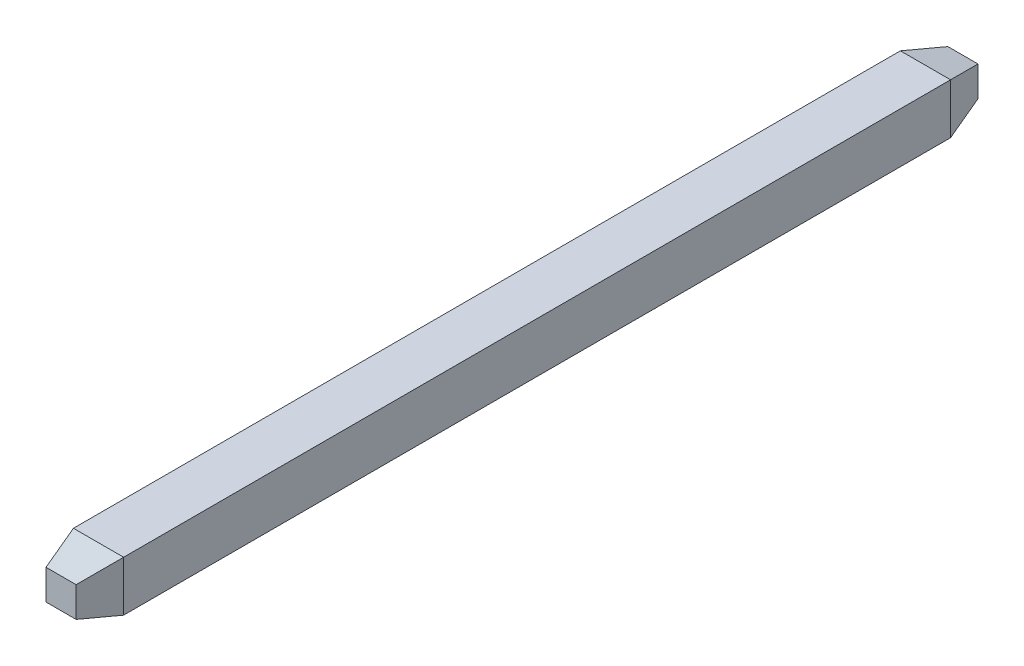
ISO-10303-21;
HEADER;
FILE_DESCRIPTION(('STEP AP214'),'2;1');
FILE_NAME('part.step','',(''),(''),'','','');
FILE_SCHEMA(('AUTOMOTIVE_DESIGN { 1 0 10303 214 1 1 1 1 }'));
ENDSEC;
DATA;
#1=APPLICATION_CONTEXT('core data for automotive mechanical design processes');
#2=APPLICATION_PROTOCOL_DEFINITION('international standard','automotive_design',2000,#1);
#3=PRODUCT_CONTEXT('',#1,'mechanical');
#4=PRODUCT('Part','Part','',(#3));
#5=PRODUCT_RELATED_PRODUCT_CATEGORY('part','',(#4));
#6=PRODUCT_DEFINITION_FORMATION('','',#4);
#7=PRODUCT_DEFINITION_CONTEXT('part definition',#1,'design');
#8=PRODUCT_DEFINITION('design','',#6,#7);
#9=PRODUCT_DEFINITION_SHAPE('','',#8);
#10=(LENGTH_UNIT() NAMED_UNIT(*) SI_UNIT(.MILLI.,.METRE.));
#11=(NAMED_UNIT(*) PLANE_ANGLE_UNIT() SI_UNIT($,.RADIAN.));
#12=(NAMED_UNIT(*) SI_UNIT($,.STERADIAN.) SOLID_ANGLE_UNIT());
#13=UNCERTAINTY_MEASURE_WITH_UNIT(LENGTH_MEASURE(1.E-05),#10,'distance_accuracy_value','');
#14=(GEOMETRIC_REPRESENTATION_CONTEXT(3) GLOBAL_UNCERTAINTY_ASSIGNED_CONTEXT((#13)) GLOBAL_UNIT_ASSIGNED_CONTEXT((#10,
#11,#12)) REPRESENTATION_CONTEXT('',''));
#15=CARTESIAN_POINT('',(0.,0.,0.));
#16=DIRECTION('',(0.,0.,1.));
#17=DIRECTION('',(1.,0.,0.));
#18=AXIS2_PLACEMENT_3D('',#15,#16,#17);
#19=CARTESIAN_POINT('',(0.32,-1.53140500673763,7.92229749663118));
#20=DIRECTION('',(0.965925826289069,0.,0.25881904510252));
#21=DIRECTION('',(0.,-1.,0.));
#22=AXIS2_PLACEMENT_3D('',#19,#20,#21);
#23=PLANE('',#22);
#24=DIRECTION('',(0.,1.,0.));
#25=VECTOR('',#24,1.);
#26=CARTESIAN_POINT('',(0.32,-0.32,7.92229749663118));
#27=LINE('',#26,#25);
#28=CARTESIAN_POINT('',(0.32,-0.32,7.92229749663118));
#29=VERTEX_POINT('',#28);
#30=CARTESIAN_POINT('',(0.32,0.32,7.92229749663118));
#31=VERTEX_POINT('',#30);
#32=EDGE_CURVE('E162',#29,#31,#27,.T.);
#33=ORIENTED_EDGE('',*,*,#32,.T.);
#34=DIRECTION('',(-0.250562807085731,-0.25056280708573,0.93511312653103));
#35=VECTOR('',#34,1.);
#36=CARTESIAN_POINT('',(0.32,0.32,7.92229749663118));
#37=LINE('',#36,#35);
#38=CARTESIAN_POINT('',(0.192,0.192,8.4));
#39=VERTEX_POINT('',#38);
#40=EDGE_CURVE('E103',#31,#39,#37,.T.);
#41=ORIENTED_EDGE('',*,*,#40,.T.);
#42=DIRECTION('',(0.,1.,0.));
#43=VECTOR('',#42,1.);
#44=CARTESIAN_POINT('',(0.192,-0.192,8.4));
#45=LINE('',#44,#43);
#46=CARTESIAN_POINT('',(0.192,-0.192,8.4));
#47=VERTEX_POINT('',#46);
#48=EDGE_CURVE('E180',#47,#39,#45,.T.);
#49=ORIENTED_EDGE('',*,*,#48,.F.);
#50=DIRECTION('',(-0.25056280708573,0.250562807085731,0.93511312653103));
#51=VECTOR('',#50,1.);
#52=CARTESIAN_POINT('',(0.32,-0.32,7.92229749663118));
#53=LINE('',#52,#51);
#54=EDGE_CURVE('E11',#29,#47,#53,.T.);
#55=ORIENTED_EDGE('',*,*,#54,.F.);
#56=EDGE_LOOP('',(#33,#41,#49,#55));
#57=FACE_BOUND('',#56,.T.);
#58=ADVANCED_FACE('F17',(#57),#23,.T.);
#59=CARTESIAN_POINT('',(-1.53140500673763,-0.32,7.92229749663118));
#60=DIRECTION('',(0.,-0.965925826289069,0.25881904510252));
#61=DIRECTION('',(-1.,0.,0.));
#62=AXIS2_PLACEMENT_3D('',#59,#60,#61);
#63=PLANE('',#62);
#64=DIRECTION('',(1.,0.,0.));
#65=VECTOR('',#64,1.);
#66=CARTESIAN_POINT('',(-0.32,-0.32,7.92229749663118));
#67=LINE('',#66,#65);
#68=CARTESIAN_POINT('',(-0.32,-0.32,7.92229749663118));
#69=VERTEX_POINT('',#68);
#70=EDGE_CURVE('E148',#69,#29,#67,.T.);
#71=ORIENTED_EDGE('',*,*,#70,.T.);
#72=ORIENTED_EDGE('',*,*,#54,.T.);
#73=DIRECTION('',(1.,0.,0.));
#74=VECTOR('',#73,1.);
#75=CARTESIAN_POINT('',(-0.192,-0.192,8.4));
#76=LINE('',#75,#74);
#77=CARTESIAN_POINT('',(-0.192,-0.192,8.4));
#78=VERTEX_POINT('',#77);
#79=EDGE_CURVE('E184',#78,#47,#76,.T.);
#80=ORIENTED_EDGE('',*,*,#79,.F.);
#81=DIRECTION('',(0.250562807085731,0.250562807085731,0.93511312653103));
#82=VECTOR('',#81,1.);
#83=CARTESIAN_POINT('',(-0.32,-0.32,7.92229749663118));
#84=LINE('',#83,#82);
#85=EDGE_CURVE('E28',#69,#78,#84,.T.);
#86=ORIENTED_EDGE('',*,*,#85,.F.);
#87=EDGE_LOOP('',(#71,#72,#80,#86));
#88=FACE_BOUND('',#87,.T.);
#89=ADVANCED_FACE('F320',(#88),#63,.T.);
#90=CARTESIAN_POINT('',(-0.32,1.53140500673763,7.92229749663118));
#91=DIRECTION('',(-0.965925826289069,0.,0.25881904510252));
#92=DIRECTION('',(0.,1.,0.));
#93=AXIS2_PLACEMENT_3D('',#90,#91,#92);
#94=PLANE('',#93);
#95=DIRECTION('',(0.,-1.,0.));
#96=VECTOR('',#95,1.);
#97=CARTESIAN_POINT('',(-0.32,0.32,7.92229749663118));
#98=LINE('',#97,#96);
#99=CARTESIAN_POINT('',(-0.32,0.32,7.92229749663118));
#100=VERTEX_POINT('',#99);
#101=EDGE_CURVE('E94',#100,#69,#98,.T.);
#102=ORIENTED_EDGE('',*,*,#101,.T.);
#103=ORIENTED_EDGE('',*,*,#85,.T.);
#104=DIRECTION('',(0.,-1.,0.));
#105=VECTOR('',#104,1.);
#106=CARTESIAN_POINT('',(-0.192,0.192,8.4));
#107=LINE('',#106,#105);
#108=CARTESIAN_POINT('',(-0.192,0.192,8.4));
#109=VERTEX_POINT('',#108);
#110=EDGE_CURVE('E97',#109,#78,#107,.T.);
#111=ORIENTED_EDGE('',*,*,#110,.F.);
#112=DIRECTION('',(0.250562807085731,-0.250562807085731,0.93511312653103));
#113=VECTOR('',#112,1.);
#114=CARTESIAN_POINT('',(-0.32,0.32,7.92229749663118));
#115=LINE('',#114,#113);
#116=EDGE_CURVE('E91',#100,#109,#115,.T.);
#117=ORIENTED_EDGE('',*,*,#116,.F.);
#118=EDGE_LOOP('',(#102,#103,#111,#117));
#119=FACE_BOUND('',#118,.T.);
#120=ADVANCED_FACE('F19',(#119),#94,.T.);
#121=CARTESIAN_POINT('',(1.53140500673763,0.32,7.92229749663118));
#122=DIRECTION('',(0.,0.965925826289069,0.25881904510252));
#123=DIRECTION('',(1.,0.,0.));
#124=AXIS2_PLACEMENT_3D('',#121,#122,#123);
#125=PLANE('',#124);
#126=DIRECTION('',(-1.,0.,0.));
#127=VECTOR('',#126,1.);
#128=CARTESIAN_POINT('',(0.32,0.32,7.92229749663118));
#129=LINE('',#128,#127);
#130=EDGE_CURVE('E21',#31,#100,#129,.T.);
#131=ORIENTED_EDGE('',*,*,#130,.T.);
#132=ORIENTED_EDGE('',*,*,#116,.T.);
#133=DIRECTION('',(-1.,0.,0.));
#134=VECTOR('',#133,1.);
#135=CARTESIAN_POINT('',(0.192,0.192,8.4));
#136=LINE('',#135,#134);
#137=EDGE_CURVE('E146',#39,#109,#136,.T.);
#138=ORIENTED_EDGE('',*,*,#137,.F.);
#139=ORIENTED_EDGE('',*,*,#40,.F.);
#140=EDGE_LOOP('',(#131,#132,#138,#139));
#141=FACE_BOUND('',#140,.T.);
#142=ADVANCED_FACE('F127',(#141),#125,.T.);
#143=CARTESIAN_POINT('',(0.32,-1.53140500673763,-2.62229749663118));
#144=DIRECTION('',(-0.965925826289068,0.,0.258819045102521));
#145=DIRECTION('',(0.,1.,0.));
#146=AXIS2_PLACEMENT_3D('',#143,#144,#145);
#147=PLANE('',#146);
#148=DIRECTION('',(0.,1.,0.));
#149=VECTOR('',#148,1.);
#150=CARTESIAN_POINT('',(0.32,-0.32,-2.62229749663118));
#151=LINE('',#150,#149);
#152=CARTESIAN_POINT('',(0.32,-0.32,-2.62229749663118));
#153=VERTEX_POINT('',#152);
#154=CARTESIAN_POINT('',(0.32,0.32,-2.62229749663118));
#155=VERTEX_POINT('',#154);
#156=EDGE_CURVE('E165',#153,#155,#151,.T.);
#157=ORIENTED_EDGE('',*,*,#156,.F.);
#158=DIRECTION('',(0.250562807085731,-0.250562807085732,0.93511312653103));
#159=VECTOR('',#158,1.);
#160=CARTESIAN_POINT('',(0.32,-0.32,-2.62229749663118));
#161=LINE('',#160,#159);
#162=CARTESIAN_POINT('',(0.192,-0.192,-3.1));
#163=VERTEX_POINT('',#162);
#164=EDGE_CURVE('E104',#163,#153,#161,.T.);
#165=ORIENTED_EDGE('',*,*,#164,.F.);
#166=DIRECTION('',(0.,1.,0.));
#167=VECTOR('',#166,1.);
#168=CARTESIAN_POINT('',(0.192,-0.192,-3.1));
#169=LINE('',#168,#167);
#170=CARTESIAN_POINT('',(0.192,0.192,-3.1));
#171=VERTEX_POINT('',#170);
#172=EDGE_CURVE('E170',#163,#171,#169,.T.);
#173=ORIENTED_EDGE('',*,*,#172,.T.);
#174=DIRECTION('',(0.250562807085731,0.250562807085731,0.93511312653103));
#175=VECTOR('',#174,1.);
#176=CARTESIAN_POINT('',(0.32,0.32,-2.62229749663118));
#177=LINE('',#176,#175);
#178=EDGE_CURVE('E82',#171,#155,#177,.T.);
#179=ORIENTED_EDGE('',*,*,#178,.T.);
#180=EDGE_LOOP('',(#157,#165,#173,#179));
#181=FACE_BOUND('',#180,.T.);
#182=ADVANCED_FACE('F310',(#181),#147,.F.);
#183=CARTESIAN_POINT('',(-1.53140500673763,-0.32,-2.62229749663118));
#184=DIRECTION('',(0.,0.965925826289068,0.258819045102521));
#185=DIRECTION('',(1.,0.,0.));
#186=AXIS2_PLACEMENT_3D('',#183,#184,#185);
#187=PLANE('',#186);
#188=DIRECTION('',(1.,0.,0.));
#189=VECTOR('',#188,1.);
#190=CARTESIAN_POINT('',(-0.32,-0.32,-2.62229749663118));
#191=LINE('',#190,#189);
#192=CARTESIAN_POINT('',(-0.32,-0.32,-2.62229749663118));
#193=VERTEX_POINT('',#192);
#194=EDGE_CURVE('E152',#193,#153,#191,.T.);
#195=ORIENTED_EDGE('',*,*,#194,.F.);
#196=DIRECTION('',(-0.250562807085731,-0.250562807085732,0.935113126531029));
#197=VECTOR('',#196,1.);
#198=CARTESIAN_POINT('',(-0.32,-0.32,-2.62229749663118));
#199=LINE('',#198,#197);
#200=CARTESIAN_POINT('',(-0.192,-0.192,-3.1));
#201=VERTEX_POINT('',#200);
#202=EDGE_CURVE('E42',#201,#193,#199,.T.);
#203=ORIENTED_EDGE('',*,*,#202,.F.);
#204=DIRECTION('',(1.,0.,0.));
#205=VECTOR('',#204,1.);
#206=CARTESIAN_POINT('',(-0.192,-0.192,-3.1));
#207=LINE('',#206,#205);
#208=EDGE_CURVE('E173',#201,#163,#207,.T.);
#209=ORIENTED_EDGE('',*,*,#208,.T.);
#210=ORIENTED_EDGE('',*,*,#164,.T.);
#211=EDGE_LOOP('',(#195,#203,#209,#210));
#212=FACE_BOUND('',#211,.T.);
#213=ADVANCED_FACE('F304',(#212),#187,.F.);
#214=CARTESIAN_POINT('',(-0.32,1.53140500673763,-2.62229749663118));
#215=DIRECTION('',(0.965925826289068,0.,0.258819045102521));
#216=DIRECTION('',(0.,-1.,0.));
#217=AXIS2_PLACEMENT_3D('',#214,#215,#216);
#218=PLANE('',#217);
#219=DIRECTION('',(0.,-1.,0.));
#220=VECTOR('',#219,1.);
#221=CARTESIAN_POINT('',(-0.32,0.32,-2.62229749663118));
#222=LINE('',#221,#220);
#223=CARTESIAN_POINT('',(-0.32,0.32,-2.62229749663118));
#224=VERTEX_POINT('',#223);
#225=EDGE_CURVE('E117',#224,#193,#222,.T.);
#226=ORIENTED_EDGE('',*,*,#225,.F.);
#227=DIRECTION('',(-0.250562807085732,0.250562807085732,0.935113126531029));
#228=VECTOR('',#227,1.);
#229=CARTESIAN_POINT('',(-0.32,0.32,-2.62229749663118));
#230=LINE('',#229,#228);
#231=CARTESIAN_POINT('',(-0.192,0.192,-3.1));
#232=VERTEX_POINT('',#231);
#233=EDGE_CURVE('E159',#232,#224,#230,.T.);
#234=ORIENTED_EDGE('',*,*,#233,.F.);
#235=DIRECTION('',(0.,-1.,0.));
#236=VECTOR('',#235,1.);
#237=CARTESIAN_POINT('',(-0.192,0.192,-3.1));
#238=LINE('',#237,#236);
#239=EDGE_CURVE('E183',#232,#201,#238,.T.);
#240=ORIENTED_EDGE('',*,*,#239,.T.);
#241=ORIENTED_EDGE('',*,*,#202,.T.);
#242=EDGE_LOOP('',(#226,#234,#240,#241));
#243=FACE_BOUND('',#242,.T.);
#244=ADVANCED_FACE('F309',(#243),#218,.F.);
#245=CARTESIAN_POINT('',(1.53140500673763,0.32,-2.62229749663118));
#246=DIRECTION('',(0.,-0.965925826289068,0.258819045102521));
#247=DIRECTION('',(-1.,0.,0.));
#248=AXIS2_PLACEMENT_3D('',#245,#246,#247);
#249=PLANE('',#248);
#250=DIRECTION('',(-1.,0.,0.));
#251=VECTOR('',#250,1.);
#252=CARTESIAN_POINT('',(0.32,0.32,-2.62229749663118));
#253=LINE('',#252,#251);
#254=EDGE_CURVE('E124',#155,#224,#253,.T.);
#255=ORIENTED_EDGE('',*,*,#254,.F.);
#256=ORIENTED_EDGE('',*,*,#178,.F.);
#257=DIRECTION('',(-1.,0.,0.));
#258=VECTOR('',#257,1.);
#259=CARTESIAN_POINT('',(0.192,0.192,-3.1));
#260=LINE('',#259,#258);
#261=EDGE_CURVE('E174',#171,#232,#260,.T.);
#262=ORIENTED_EDGE('',*,*,#261,.T.);
#263=ORIENTED_EDGE('',*,*,#233,.T.);
#264=EDGE_LOOP('',(#255,#256,#262,#263));
#265=FACE_BOUND('',#264,.T.);
#266=ADVANCED_FACE('F336',(#265),#249,.F.);
#267=CARTESIAN_POINT('',(0.,0.,-3.1));
#268=DIRECTION('',(0.,0.,1.));
#269=DIRECTION('',(1.,0.,0.));
#270=AXIS2_PLACEMENT_3D('',#267,#268,#269);
#271=PLANE('',#270);
#272=ORIENTED_EDGE('',*,*,#261,.F.);
#273=ORIENTED_EDGE('',*,*,#172,.F.);
#274=ORIENTED_EDGE('',*,*,#208,.F.);
#275=ORIENTED_EDGE('',*,*,#239,.F.);
#276=EDGE_LOOP('',(#272,#273,#274,#275));
#277=FACE_BOUND('',#276,.T.);
#278=ADVANCED_FACE('F288',(#277),#271,.F.);
#279=CARTESIAN_POINT('',(0.,0.,8.4));
#280=DIRECTION('',(0.,0.,1.));
#281=DIRECTION('',(1.,0.,0.));
#282=AXIS2_PLACEMENT_3D('',#279,#280,#281);
#283=PLANE('',#282);
#284=ORIENTED_EDGE('',*,*,#137,.T.);
#285=ORIENTED_EDGE('',*,*,#110,.T.);
#286=ORIENTED_EDGE('',*,*,#79,.T.);
#287=ORIENTED_EDGE('',*,*,#48,.T.);
#288=EDGE_LOOP('',(#284,#285,#286,#287));
#289=FACE_BOUND('',#288,.T.);
#290=ADVANCED_FACE('F203',(#289),#283,.T.);
#291=CARTESIAN_POINT('',(0.32,-0.32,-3.1));
#292=DIRECTION('',(1.,0.,0.));
#293=DIRECTION('',(0.,1.,0.));
#294=AXIS2_PLACEMENT_3D('',#291,#292,#293);
#295=PLANE('',#294);
#296=ORIENTED_EDGE('',*,*,#32,.F.);
#297=DIRECTION('',(0.,0.,1.));
#298=VECTOR('',#297,1.);
#299=CARTESIAN_POINT('',(0.32,-0.32,-2.62229749663118));
#300=LINE('',#299,#298);
#301=EDGE_CURVE('E156',#153,#29,#300,.T.);
#302=ORIENTED_EDGE('',*,*,#301,.F.);
#303=ORIENTED_EDGE('',*,*,#156,.T.);
#304=DIRECTION('',(0.,0.,1.));
#305=VECTOR('',#304,1.);
#306=CARTESIAN_POINT('',(0.32,0.32,-2.62229749663118));
#307=LINE('',#306,#305);
#308=EDGE_CURVE('E131',#155,#31,#307,.T.);
#309=ORIENTED_EDGE('',*,*,#308,.T.);
#310=EDGE_LOOP('',(#296,#302,#303,#309));
#311=FACE_BOUND('',#310,.T.);
#312=ADVANCED_FACE('F287',(#311),#295,.T.);
#313=CARTESIAN_POINT('',(-0.32,-0.32,-3.1));
#314=DIRECTION('',(0.,-1.,0.));
#315=DIRECTION('',(0.,0.,-1.));
#316=AXIS2_PLACEMENT_3D('',#313,#314,#315);
#317=PLANE('',#316);
#318=ORIENTED_EDGE('',*,*,#70,.F.);
#319=DIRECTION('',(0.,0.,1.));
#320=VECTOR('',#319,1.);
#321=CARTESIAN_POINT('',(-0.32,-0.32,-2.62229749663118));
#322=LINE('',#321,#320);
#323=EDGE_CURVE('E115',#193,#69,#322,.T.);
#324=ORIENTED_EDGE('',*,*,#323,.F.);
#325=ORIENTED_EDGE('',*,*,#194,.T.);
#326=ORIENTED_EDGE('',*,*,#301,.T.);
#327=EDGE_LOOP('',(#318,#324,#325,#326));
#328=FACE_BOUND('',#327,.T.);
#329=ADVANCED_FACE('F294',(#328),#317,.T.);
#330=CARTESIAN_POINT('',(-0.32,0.32,-3.1));
#331=DIRECTION('',(-1.,0.,0.));
#332=DIRECTION('',(0.,1.,0.));
#333=AXIS2_PLACEMENT_3D('',#330,#331,#332);
#334=PLANE('',#333);
#335=ORIENTED_EDGE('',*,*,#101,.F.);
#336=DIRECTION('',(0.,0.,1.));
#337=VECTOR('',#336,1.);
#338=CARTESIAN_POINT('',(-0.32,0.32,-2.62229749663118));
#339=LINE('',#338,#337);
#340=EDGE_CURVE('E112',#224,#100,#339,.T.);
#341=ORIENTED_EDGE('',*,*,#340,.F.);
#342=ORIENTED_EDGE('',*,*,#225,.T.);
#343=ORIENTED_EDGE('',*,*,#323,.T.);
#344=EDGE_LOOP('',(#335,#341,#342,#343));
#345=FACE_BOUND('',#344,.T.);
#346=ADVANCED_FACE('F110',(#345),#334,.T.);
#347=CARTESIAN_POINT('',(0.32,0.32,-3.1));
#348=DIRECTION('',(0.,1.,0.));
#349=DIRECTION('',(1.,0.,0.));
#350=AXIS2_PLACEMENT_3D('',#347,#348,#349);
#351=PLANE('',#350);
#352=ORIENTED_EDGE('',*,*,#130,.F.);
#353=ORIENTED_EDGE('',*,*,#308,.F.);
#354=ORIENTED_EDGE('',*,*,#254,.T.);
#355=ORIENTED_EDGE('',*,*,#340,.T.);
#356=EDGE_LOOP('',(#352,#353,#354,#355));
#357=FACE_BOUND('',#356,.T.);
#358=ADVANCED_FACE('F121',(#357),#351,.T.);
#359=CLOSED_SHELL('',(#58,#89,#120,#142,#182,#213,#244,#266,#278,#290,#312,#329,#346,#358));
#360=MANIFOLD_SOLID_BREP('B1',#359);
#361=ADVANCED_BREP_SHAPE_REPRESENTATION('',(#18,#360),#14);
#362=SHAPE_DEFINITION_REPRESENTATION(#9,#361);
ENDSEC;
END-ISO-10303-21;
